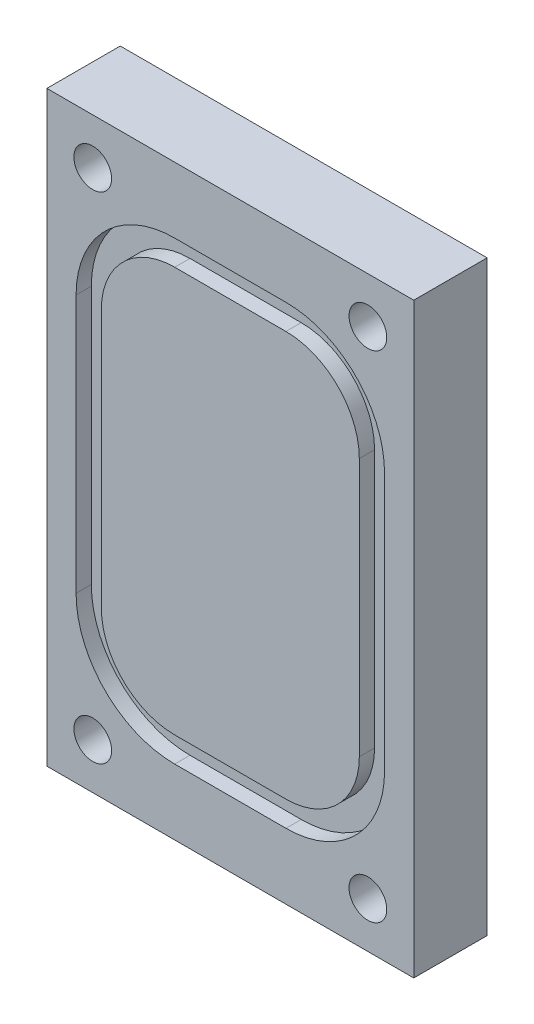
ISO-10303-21;
HEADER;
FILE_DESCRIPTION(('STEP AP214'),'2;1');
FILE_NAME('part.step','',(''),(''),'','','');
FILE_SCHEMA(('AUTOMOTIVE_DESIGN { 1 0 10303 214 1 1 1 1 }'));
ENDSEC;
DATA;
#1=APPLICATION_CONTEXT('core data for automotive mechanical design processes');
#2=APPLICATION_PROTOCOL_DEFINITION('international standard','automotive_design',2000,#1);
#3=PRODUCT_CONTEXT('',#1,'mechanical');
#4=PRODUCT('Part','Part','',(#3));
#5=PRODUCT_RELATED_PRODUCT_CATEGORY('part','',(#4));
#6=PRODUCT_DEFINITION_FORMATION('','',#4);
#7=PRODUCT_DEFINITION_CONTEXT('part definition',#1,'design');
#8=PRODUCT_DEFINITION('design','',#6,#7);
#9=PRODUCT_DEFINITION_SHAPE('','',#8);
#10=(LENGTH_UNIT() NAMED_UNIT(*) SI_UNIT(.MILLI.,.METRE.));
#11=(NAMED_UNIT(*) PLANE_ANGLE_UNIT() SI_UNIT($,.RADIAN.));
#12=(NAMED_UNIT(*) SI_UNIT($,.STERADIAN.) SOLID_ANGLE_UNIT());
#13=UNCERTAINTY_MEASURE_WITH_UNIT(LENGTH_MEASURE(1.E-05),#10,'distance_accuracy_value','');
#14=(GEOMETRIC_REPRESENTATION_CONTEXT(3) GLOBAL_UNCERTAINTY_ASSIGNED_CONTEXT((#13)) GLOBAL_UNIT_ASSIGNED_CONTEXT((#10,
#11,#12)) REPRESENTATION_CONTEXT('',''));
#15=CARTESIAN_POINT('',(0.,0.,0.));
#16=DIRECTION('',(0.,0.,1.));
#17=DIRECTION('',(1.,0.,0.));
#18=AXIS2_PLACEMENT_3D('',#15,#16,#17);
#19=CARTESIAN_POINT('',(15.875,-25.4,6.35));
#20=DIRECTION('',(-1.,0.,0.));
#21=DIRECTION('',(0.,0.,1.));
#22=AXIS2_PLACEMENT_3D('',#19,#20,#21);
#23=PLANE('',#22);
#24=DIRECTION('',(0.,1.,0.));
#25=VECTOR('',#24,1.);
#26=CARTESIAN_POINT('',(15.875,-25.4,0.));
#27=LINE('',#26,#25);
#28=CARTESIAN_POINT('',(15.875,-25.4,0.));
#29=VERTEX_POINT('',#28);
#30=CARTESIAN_POINT('',(15.875,25.4,0.));
#31=VERTEX_POINT('',#30);
#32=EDGE_CURVE('E297',#29,#31,#27,.T.);
#33=ORIENTED_EDGE('',*,*,#32,.T.);
#34=DIRECTION('',(0.,0.,-1.));
#35=VECTOR('',#34,1.);
#36=CARTESIAN_POINT('',(15.875,25.4,6.35));
#37=LINE('',#36,#35);
#38=CARTESIAN_POINT('',(15.875,25.4,6.35));
#39=VERTEX_POINT('',#38);
#40=EDGE_CURVE('E11',#39,#31,#37,.T.);
#41=ORIENTED_EDGE('',*,*,#40,.F.);
#42=DIRECTION('',(0.,1.,0.));
#43=VECTOR('',#42,1.);
#44=CARTESIAN_POINT('',(15.875,-25.4,6.35));
#45=LINE('',#44,#43);
#46=CARTESIAN_POINT('',(15.875,-25.4,6.35));
#47=VERTEX_POINT('',#46);
#48=EDGE_CURVE('E311',#47,#39,#45,.T.);
#49=ORIENTED_EDGE('',*,*,#48,.F.);
#50=DIRECTION('',(0.,0.,-1.));
#51=VECTOR('',#50,1.);
#52=CARTESIAN_POINT('',(15.875,-25.4,6.35));
#53=LINE('',#52,#51);
#54=EDGE_CURVE('E321',#47,#29,#53,.T.);
#55=ORIENTED_EDGE('',*,*,#54,.T.);
#56=EDGE_LOOP('',(#33,#41,#49,#55));
#57=FACE_BOUND('',#56,.T.);
#58=ADVANCED_FACE('F35',(#57),#23,.F.);
#59=CARTESIAN_POINT('',(-15.875,25.4,6.35));
#60=DIRECTION('',(0.,-1.,0.));
#61=DIRECTION('',(0.,0.,-1.));
#62=AXIS2_PLACEMENT_3D('',#59,#60,#61);
#63=PLANE('',#62);
#64=DIRECTION('',(-1.,0.,0.));
#65=VECTOR('',#64,1.);
#66=CARTESIAN_POINT('',(-15.875,25.4,0.));
#67=LINE('',#66,#65);
#68=CARTESIAN_POINT('',(-15.875,25.4,0.));
#69=VERTEX_POINT('',#68);
#70=EDGE_CURVE('E324',#31,#69,#67,.T.);
#71=ORIENTED_EDGE('',*,*,#70,.T.);
#72=DIRECTION('',(0.,0.,-1.));
#73=VECTOR('',#72,1.);
#74=CARTESIAN_POINT('',(-15.875,25.4,6.35));
#75=LINE('',#74,#73);
#76=CARTESIAN_POINT('',(-15.875,25.4,6.35));
#77=VERTEX_POINT('',#76);
#78=EDGE_CURVE('E42',#77,#69,#75,.T.);
#79=ORIENTED_EDGE('',*,*,#78,.F.);
#80=DIRECTION('',(-1.,0.,0.));
#81=VECTOR('',#80,1.);
#82=CARTESIAN_POINT('',(-15.875,25.4,6.35));
#83=LINE('',#82,#81);
#84=EDGE_CURVE('E314',#39,#77,#83,.T.);
#85=ORIENTED_EDGE('',*,*,#84,.F.);
#86=ORIENTED_EDGE('',*,*,#40,.T.);
#87=EDGE_LOOP('',(#71,#79,#85,#86));
#88=FACE_BOUND('',#87,.T.);
#89=ADVANCED_FACE('F354',(#88),#63,.F.);
#90=CARTESIAN_POINT('',(-15.875,-25.4,6.35));
#91=DIRECTION('',(1.,0.,0.));
#92=DIRECTION('',(0.,0.,-1.));
#93=AXIS2_PLACEMENT_3D('',#90,#91,#92);
#94=PLANE('',#93);
#95=DIRECTION('',(0.,-1.,0.));
#96=VECTOR('',#95,1.);
#97=CARTESIAN_POINT('',(-15.875,-25.4,0.));
#98=LINE('',#97,#96);
#99=CARTESIAN_POINT('',(-15.875,-25.4,0.));
#100=VERTEX_POINT('',#99);
#101=EDGE_CURVE('E326',#69,#100,#98,.T.);
#102=ORIENTED_EDGE('',*,*,#101,.T.);
#103=DIRECTION('',(0.,0.,-1.));
#104=VECTOR('',#103,1.);
#105=CARTESIAN_POINT('',(-15.875,-25.4,6.35));
#106=LINE('',#105,#104);
#107=CARTESIAN_POINT('',(-15.875,-25.4,6.35));
#108=VERTEX_POINT('',#107);
#109=EDGE_CURVE('E331',#108,#100,#106,.T.);
#110=ORIENTED_EDGE('',*,*,#109,.F.);
#111=DIRECTION('',(0.,-1.,0.));
#112=VECTOR('',#111,1.);
#113=CARTESIAN_POINT('',(-15.875,-25.4,6.35));
#114=LINE('',#113,#112);
#115=EDGE_CURVE('E317',#77,#108,#114,.T.);
#116=ORIENTED_EDGE('',*,*,#115,.F.);
#117=ORIENTED_EDGE('',*,*,#78,.T.);
#118=EDGE_LOOP('',(#102,#110,#116,#117));
#119=FACE_BOUND('',#118,.T.);
#120=ADVANCED_FACE('F338',(#119),#94,.F.);
#121=CARTESIAN_POINT('',(-15.875,-25.4,6.35));
#122=DIRECTION('',(0.,1.,0.));
#123=DIRECTION('',(0.,0.,1.));
#124=AXIS2_PLACEMENT_3D('',#121,#122,#123);
#125=PLANE('',#124);
#126=DIRECTION('',(1.,0.,0.));
#127=VECTOR('',#126,1.);
#128=CARTESIAN_POINT('',(-15.875,-25.4,0.));
#129=LINE('',#128,#127);
#130=EDGE_CURVE('E315',#100,#29,#129,.T.);
#131=ORIENTED_EDGE('',*,*,#130,.T.);
#132=ORIENTED_EDGE('',*,*,#54,.F.);
#133=DIRECTION('',(1.,0.,0.));
#134=VECTOR('',#133,1.);
#135=CARTESIAN_POINT('',(-15.875,-25.4,6.35));
#136=LINE('',#135,#134);
#137=EDGE_CURVE('E319',#108,#47,#136,.T.);
#138=ORIENTED_EDGE('',*,*,#137,.F.);
#139=ORIENTED_EDGE('',*,*,#109,.T.);
#140=EDGE_LOOP('',(#131,#132,#138,#139));
#141=FACE_BOUND('',#140,.T.);
#142=ADVANCED_FACE('F347',(#141),#125,.F.);
#143=CARTESIAN_POINT('',(15.875,25.4,6.35));
#144=DIRECTION('',(0.,0.,-1.));
#145=DIRECTION('',(-1.,0.,0.));
#146=AXIS2_PLACEMENT_3D('',#143,#144,#145);
#147=PLANE('',#146);
#148=CARTESIAN_POINT('',(11.90625,21.43125,6.35));
#149=DIRECTION('',(0.,0.,-1.));
#150=DIRECTION('',(-1.,0.,0.));
#151=AXIS2_PLACEMENT_3D('',#148,#149,#150);
#152=CIRCLE('',#151,1.63195);
#153=CARTESIAN_POINT('',(10.2743,21.43125,6.35));
#154=VERTEX_POINT('',#153);
#155=EDGE_CURVE('E472',#154,#154,#152,.T.);
#156=ORIENTED_EDGE('',*,*,#155,.T.);
#157=EDGE_LOOP('',(#156));
#158=FACE_BOUND('',#157,.T.);
#159=CARTESIAN_POINT('',(-11.90625,21.43125,6.35));
#160=DIRECTION('',(0.,0.,-1.));
#161=DIRECTION('',(-1.,0.,0.));
#162=AXIS2_PLACEMENT_3D('',#159,#160,#161);
#163=CIRCLE('',#162,1.63195);
#164=CARTESIAN_POINT('',(-13.5382,21.43125,6.35));
#165=VERTEX_POINT('',#164);
#166=EDGE_CURVE('E483',#165,#165,#163,.T.);
#167=ORIENTED_EDGE('',*,*,#166,.T.);
#168=EDGE_LOOP('',(#167));
#169=FACE_BOUND('',#168,.T.);
#170=CARTESIAN_POINT('',(11.90625,-21.43125,6.35));
#171=DIRECTION('',(0.,0.,-1.));
#172=DIRECTION('',(-1.,0.,0.));
#173=AXIS2_PLACEMENT_3D('',#170,#171,#172);
#174=CIRCLE('',#173,1.63195);
#175=CARTESIAN_POINT('',(10.2743,-21.43125,6.35));
#176=VERTEX_POINT('',#175);
#177=EDGE_CURVE('E492',#176,#176,#174,.T.);
#178=ORIENTED_EDGE('',*,*,#177,.T.);
#179=EDGE_LOOP('',(#178));
#180=FACE_BOUND('',#179,.T.);
#181=CARTESIAN_POINT('',(-11.90625,-21.43125,6.35));
#182=DIRECTION('',(0.,0.,-1.));
#183=DIRECTION('',(-1.,0.,0.));
#184=AXIS2_PLACEMENT_3D('',#181,#182,#183);
#185=CIRCLE('',#184,1.63195);
#186=CARTESIAN_POINT('',(-13.5382,-21.43125,6.35));
#187=VERTEX_POINT('',#186);
#188=EDGE_CURVE('E204',#187,#187,#185,.T.);
#189=ORIENTED_EDGE('',*,*,#188,.T.);
#190=EDGE_LOOP('',(#189));
#191=FACE_BOUND('',#190,.T.);
#192=DIRECTION('',(-1.,0.,0.));
#193=VECTOR('',#192,1.);
#194=CARTESIAN_POINT('',(-4.8133,19.7104,6.35));
#195=LINE('',#194,#193);
#196=CARTESIAN_POINT('',(4.8133,19.7104,6.35));
#197=VERTEX_POINT('',#196);
#198=CARTESIAN_POINT('',(-4.8133,19.7104,6.35));
#199=VERTEX_POINT('',#198);
#200=EDGE_CURVE('E275',#197,#199,#195,.T.);
#201=ORIENTED_EDGE('',*,*,#200,.F.);
#202=CARTESIAN_POINT('',(4.8133,11.176,6.35));
#203=DIRECTION('',(0.,0.,1.));
#204=DIRECTION('',(-1.,0.,0.));
#205=AXIS2_PLACEMENT_3D('',#202,#203,#204);
#206=CIRCLE('',#205,8.5344);
#207=CARTESIAN_POINT('',(13.3477,11.176,6.35));
#208=VERTEX_POINT('',#207);
#209=EDGE_CURVE('E49',#208,#197,#206,.T.);
#210=ORIENTED_EDGE('',*,*,#209,.F.);
#211=DIRECTION('',(0.,1.,0.));
#212=VECTOR('',#211,1.);
#213=CARTESIAN_POINT('',(13.3477,-11.176,6.35));
#214=LINE('',#213,#212);
#215=CARTESIAN_POINT('',(13.3477,-11.176,6.35));
#216=VERTEX_POINT('',#215);
#217=EDGE_CURVE('E252',#216,#208,#214,.T.);
#218=ORIENTED_EDGE('',*,*,#217,.F.);
#219=CARTESIAN_POINT('',(4.8133,-11.176,6.35));
#220=DIRECTION('',(0.,0.,1.));
#221=DIRECTION('',(1.,0.,0.));
#222=AXIS2_PLACEMENT_3D('',#219,#220,#221);
#223=CIRCLE('',#222,8.5344);
#224=CARTESIAN_POINT('',(4.8133,-19.7104,6.35));
#225=VERTEX_POINT('',#224);
#226=EDGE_CURVE('E290',#225,#216,#223,.T.);
#227=ORIENTED_EDGE('',*,*,#226,.F.);
#228=DIRECTION('',(1.,0.,0.));
#229=VECTOR('',#228,1.);
#230=CARTESIAN_POINT('',(-4.8133,-19.7104,6.35));
#231=LINE('',#230,#229);
#232=CARTESIAN_POINT('',(-4.8133,-19.7104,6.35));
#233=VERTEX_POINT('',#232);
#234=EDGE_CURVE('E287',#233,#225,#231,.T.);
#235=ORIENTED_EDGE('',*,*,#234,.F.);
#236=CARTESIAN_POINT('',(-4.8133,-11.176,6.35));
#237=DIRECTION('',(0.,0.,1.));
#238=DIRECTION('',(-1.,0.,0.));
#239=AXIS2_PLACEMENT_3D('',#236,#237,#238);
#240=CIRCLE('',#239,8.5344);
#241=CARTESIAN_POINT('',(-13.3477,-11.176,6.35));
#242=VERTEX_POINT('',#241);
#243=EDGE_CURVE('E284',#242,#233,#240,.T.);
#244=ORIENTED_EDGE('',*,*,#243,.F.);
#245=DIRECTION('',(0.,-1.,0.));
#246=VECTOR('',#245,1.);
#247=CARTESIAN_POINT('',(-13.3477,-11.176,6.35));
#248=LINE('',#247,#246);
#249=CARTESIAN_POINT('',(-13.3477,11.176,6.35));
#250=VERTEX_POINT('',#249);
#251=EDGE_CURVE('E281',#250,#242,#248,.T.);
#252=ORIENTED_EDGE('',*,*,#251,.F.);
#253=CARTESIAN_POINT('',(-4.8133,11.176,6.35));
#254=DIRECTION('',(0.,0.,1.));
#255=DIRECTION('',(-1.,0.,0.));
#256=AXIS2_PLACEMENT_3D('',#253,#254,#255);
#257=CIRCLE('',#256,8.5344);
#258=EDGE_CURVE('E278',#199,#250,#257,.T.);
#259=ORIENTED_EDGE('',*,*,#258,.F.);
#260=EDGE_LOOP('',(#201,#210,#218,#227,#235,#244,#252,#259));
#261=FACE_BOUND('',#260,.T.);
#262=ORIENTED_EDGE('',*,*,#48,.T.);
#263=ORIENTED_EDGE('',*,*,#84,.T.);
#264=ORIENTED_EDGE('',*,*,#115,.T.);
#265=ORIENTED_EDGE('',*,*,#137,.T.);
#266=EDGE_LOOP('',(#262,#263,#264,#265));
#267=FACE_BOUND('',#266,.T.);
#268=ADVANCED_FACE('F353',(#158,#169,#180,#191,#261,#267),#147,.F.);
#269=CARTESIAN_POINT('',(15.875,25.4,0.));
#270=DIRECTION('',(0.,0.,-1.));
#271=DIRECTION('',(-1.,0.,0.));
#272=AXIS2_PLACEMENT_3D('',#269,#270,#271);
#273=PLANE('',#272);
#274=CARTESIAN_POINT('',(11.90625,21.43125,0.));
#275=DIRECTION('',(0.,0.,-1.));
#276=DIRECTION('',(-1.,0.,0.));
#277=AXIS2_PLACEMENT_3D('',#274,#275,#276);
#278=CIRCLE('',#277,2.8575);
#279=CARTESIAN_POINT('',(9.04875,21.43125,0.));
#280=VERTEX_POINT('',#279);
#281=EDGE_CURVE('E470',#280,#280,#278,.T.);
#282=ORIENTED_EDGE('',*,*,#281,.F.);
#283=EDGE_LOOP('',(#282));
#284=FACE_BOUND('',#283,.T.);
#285=CARTESIAN_POINT('',(-11.90625,21.43125,0.));
#286=DIRECTION('',(0.,0.,-1.));
#287=DIRECTION('',(-1.,0.,0.));
#288=AXIS2_PLACEMENT_3D('',#285,#286,#287);
#289=CIRCLE('',#288,2.8575);
#290=CARTESIAN_POINT('',(-14.76375,21.43125,0.));
#291=VERTEX_POINT('',#290);
#292=EDGE_CURVE('E477',#291,#291,#289,.T.);
#293=ORIENTED_EDGE('',*,*,#292,.F.);
#294=EDGE_LOOP('',(#293));
#295=FACE_BOUND('',#294,.T.);
#296=CARTESIAN_POINT('',(11.90625,-21.43125,0.));
#297=DIRECTION('',(0.,0.,-1.));
#298=DIRECTION('',(-1.,0.,0.));
#299=AXIS2_PLACEMENT_3D('',#296,#297,#298);
#300=CIRCLE('',#299,2.8575);
#301=CARTESIAN_POINT('',(9.04875,-21.43125,0.));
#302=VERTEX_POINT('',#301);
#303=EDGE_CURVE('E486',#302,#302,#300,.T.);
#304=ORIENTED_EDGE('',*,*,#303,.F.);
#305=EDGE_LOOP('',(#304));
#306=FACE_BOUND('',#305,.T.);
#307=CARTESIAN_POINT('',(-11.90625,-21.43125,0.));
#308=DIRECTION('',(0.,0.,-1.));
#309=DIRECTION('',(-1.,0.,0.));
#310=AXIS2_PLACEMENT_3D('',#307,#308,#309);
#311=CIRCLE('',#310,2.8575);
#312=CARTESIAN_POINT('',(-14.76375,-21.43125,0.));
#313=VERTEX_POINT('',#312);
#314=EDGE_CURVE('E495',#313,#313,#311,.T.);
#315=ORIENTED_EDGE('',*,*,#314,.F.);
#316=EDGE_LOOP('',(#315));
#317=FACE_BOUND('',#316,.T.);
#318=ORIENTED_EDGE('',*,*,#32,.F.);
#319=ORIENTED_EDGE('',*,*,#130,.F.);
#320=ORIENTED_EDGE('',*,*,#101,.F.);
#321=ORIENTED_EDGE('',*,*,#70,.F.);
#322=EDGE_LOOP('',(#318,#319,#320,#321));
#323=FACE_BOUND('',#322,.T.);
#324=ADVANCED_FACE('F344',(#284,#295,#306,#317,#323),#273,.T.);
#325=CARTESIAN_POINT('',(4.8133,11.176,5.0292));
#326=DIRECTION('',(0.,0.,1.));
#327=DIRECTION('',(1.,0.,0.));
#328=AXIS2_PLACEMENT_3D('',#325,#326,#327);
#329=CYLINDRICAL_SURFACE('',#328,8.5344);
#330=ORIENTED_EDGE('',*,*,#209,.T.);
#331=DIRECTION('',(0.,0.,1.));
#332=VECTOR('',#331,1.);
#333=CARTESIAN_POINT('',(4.8133,19.7104,5.0292));
#334=LINE('',#333,#332);
#335=CARTESIAN_POINT('',(4.8133,19.7104,5.0292));
#336=VERTEX_POINT('',#335);
#337=EDGE_CURVE('E273',#336,#197,#334,.T.);
#338=ORIENTED_EDGE('',*,*,#337,.F.);
#339=CARTESIAN_POINT('',(4.8133,11.176,5.0292));
#340=DIRECTION('',(0.,0.,1.));
#341=DIRECTION('',(-1.,0.,0.));
#342=AXIS2_PLACEMENT_3D('',#339,#340,#341);
#343=CIRCLE('',#342,8.5344);
#344=CARTESIAN_POINT('',(13.3477,11.176,5.0292));
#345=VERTEX_POINT('',#344);
#346=EDGE_CURVE('E248',#345,#336,#343,.T.);
#347=ORIENTED_EDGE('',*,*,#346,.F.);
#348=DIRECTION('',(0.,0.,1.));
#349=VECTOR('',#348,1.);
#350=CARTESIAN_POINT('',(13.3477,11.176,5.0292));
#351=LINE('',#350,#349);
#352=EDGE_CURVE('E295',#345,#208,#351,.T.);
#353=ORIENTED_EDGE('',*,*,#352,.T.);
#354=EDGE_LOOP('',(#330,#338,#347,#353));
#355=FACE_BOUND('',#354,.T.);
#356=ADVANCED_FACE('F366',(#355),#329,.F.);
#357=CARTESIAN_POINT('',(13.3477,-11.176,5.0292));
#358=DIRECTION('',(1.,0.,0.));
#359=DIRECTION('',(0.,0.,-1.));
#360=AXIS2_PLACEMENT_3D('',#357,#358,#359);
#361=PLANE('',#360);
#362=ORIENTED_EDGE('',*,*,#217,.T.);
#363=ORIENTED_EDGE('',*,*,#352,.F.);
#364=DIRECTION('',(0.,1.,0.));
#365=VECTOR('',#364,1.);
#366=CARTESIAN_POINT('',(13.3477,-11.176,5.0292));
#367=LINE('',#366,#365);
#368=CARTESIAN_POINT('',(13.3477,-11.176,5.0292));
#369=VERTEX_POINT('',#368);
#370=EDGE_CURVE('E270',#369,#345,#367,.T.);
#371=ORIENTED_EDGE('',*,*,#370,.F.);
#372=DIRECTION('',(0.,0.,1.));
#373=VECTOR('',#372,1.);
#374=CARTESIAN_POINT('',(13.3477,-11.176,5.0292));
#375=LINE('',#374,#373);
#376=EDGE_CURVE('E298',#369,#216,#375,.T.);
#377=ORIENTED_EDGE('',*,*,#376,.T.);
#378=EDGE_LOOP('',(#362,#363,#371,#377));
#379=FACE_BOUND('',#378,.T.);
#380=ADVANCED_FACE('F374',(#379),#361,.F.);
#381=CARTESIAN_POINT('',(4.8133,-11.176,5.0292));
#382=DIRECTION('',(0.,0.,1.));
#383=DIRECTION('',(1.,0.,0.));
#384=AXIS2_PLACEMENT_3D('',#381,#382,#383);
#385=CYLINDRICAL_SURFACE('',#384,8.5344);
#386=ORIENTED_EDGE('',*,*,#226,.T.);
#387=ORIENTED_EDGE('',*,*,#376,.F.);
#388=CARTESIAN_POINT('',(4.8133,-11.176,5.0292));
#389=DIRECTION('',(0.,0.,1.));
#390=DIRECTION('',(1.,0.,0.));
#391=AXIS2_PLACEMENT_3D('',#388,#389,#390);
#392=CIRCLE('',#391,8.5344);
#393=CARTESIAN_POINT('',(4.8133,-19.7104,5.0292));
#394=VERTEX_POINT('',#393);
#395=EDGE_CURVE('E267',#394,#369,#392,.T.);
#396=ORIENTED_EDGE('',*,*,#395,.F.);
#397=DIRECTION('',(0.,0.,1.));
#398=VECTOR('',#397,1.);
#399=CARTESIAN_POINT('',(4.8133,-19.7104,5.0292));
#400=LINE('',#399,#398);
#401=EDGE_CURVE('E300',#394,#225,#400,.T.);
#402=ORIENTED_EDGE('',*,*,#401,.T.);
#403=EDGE_LOOP('',(#386,#387,#396,#402));
#404=FACE_BOUND('',#403,.T.);
#405=ADVANCED_FACE('F394',(#404),#385,.F.);
#406=CARTESIAN_POINT('',(-4.8133,-19.7104,5.0292));
#407=DIRECTION('',(0.,-1.,0.));
#408=DIRECTION('',(0.,0.,-1.));
#409=AXIS2_PLACEMENT_3D('',#406,#407,#408);
#410=PLANE('',#409);
#411=ORIENTED_EDGE('',*,*,#234,.T.);
#412=ORIENTED_EDGE('',*,*,#401,.F.);
#413=DIRECTION('',(1.,0.,0.));
#414=VECTOR('',#413,1.);
#415=CARTESIAN_POINT('',(-4.8133,-19.7104,5.0292));
#416=LINE('',#415,#414);
#417=CARTESIAN_POINT('',(-4.8133,-19.7104,5.0292));
#418=VERTEX_POINT('',#417);
#419=EDGE_CURVE('E264',#418,#394,#416,.T.);
#420=ORIENTED_EDGE('',*,*,#419,.F.);
#421=DIRECTION('',(0.,0.,1.));
#422=VECTOR('',#421,1.);
#423=CARTESIAN_POINT('',(-4.8133,-19.7104,5.0292));
#424=LINE('',#423,#422);
#425=EDGE_CURVE('E302',#418,#233,#424,.T.);
#426=ORIENTED_EDGE('',*,*,#425,.T.);
#427=EDGE_LOOP('',(#411,#412,#420,#426));
#428=FACE_BOUND('',#427,.T.);
#429=ADVANCED_FACE('F390',(#428),#410,.F.);
#430=CARTESIAN_POINT('',(-4.8133,-11.176,5.0292));
#431=DIRECTION('',(0.,0.,1.));
#432=DIRECTION('',(1.,0.,0.));
#433=AXIS2_PLACEMENT_3D('',#430,#431,#432);
#434=CYLINDRICAL_SURFACE('',#433,8.5344);
#435=ORIENTED_EDGE('',*,*,#243,.T.);
#436=ORIENTED_EDGE('',*,*,#425,.F.);
#437=CARTESIAN_POINT('',(-4.8133,-11.176,5.0292));
#438=DIRECTION('',(0.,0.,1.));
#439=DIRECTION('',(-1.,0.,0.));
#440=AXIS2_PLACEMENT_3D('',#437,#438,#439);
#441=CIRCLE('',#440,8.5344);
#442=CARTESIAN_POINT('',(-13.3477,-11.176,5.0292));
#443=VERTEX_POINT('',#442);
#444=EDGE_CURVE('E261',#443,#418,#441,.T.);
#445=ORIENTED_EDGE('',*,*,#444,.F.);
#446=DIRECTION('',(0.,0.,1.));
#447=VECTOR('',#446,1.);
#448=CARTESIAN_POINT('',(-13.3477,-11.176,5.0292));
#449=LINE('',#448,#447);
#450=EDGE_CURVE('E304',#443,#242,#449,.T.);
#451=ORIENTED_EDGE('',*,*,#450,.T.);
#452=EDGE_LOOP('',(#435,#436,#445,#451));
#453=FACE_BOUND('',#452,.T.);
#454=ADVANCED_FACE('F386',(#453),#434,.F.);
#455=CARTESIAN_POINT('',(-13.3477,-11.176,5.0292));
#456=DIRECTION('',(-1.,0.,0.));
#457=DIRECTION('',(0.,0.,1.));
#458=AXIS2_PLACEMENT_3D('',#455,#456,#457);
#459=PLANE('',#458);
#460=ORIENTED_EDGE('',*,*,#251,.T.);
#461=ORIENTED_EDGE('',*,*,#450,.F.);
#462=DIRECTION('',(0.,-1.,0.));
#463=VECTOR('',#462,1.);
#464=CARTESIAN_POINT('',(-13.3477,-11.176,5.0292));
#465=LINE('',#464,#463);
#466=CARTESIAN_POINT('',(-13.3477,11.176,5.0292));
#467=VERTEX_POINT('',#466);
#468=EDGE_CURVE('E258',#467,#443,#465,.T.);
#469=ORIENTED_EDGE('',*,*,#468,.F.);
#470=DIRECTION('',(0.,0.,1.));
#471=VECTOR('',#470,1.);
#472=CARTESIAN_POINT('',(-13.3477,11.176,5.0292));
#473=LINE('',#472,#471);
#474=EDGE_CURVE('E306',#467,#250,#473,.T.);
#475=ORIENTED_EDGE('',*,*,#474,.T.);
#476=EDGE_LOOP('',(#460,#461,#469,#475));
#477=FACE_BOUND('',#476,.T.);
#478=ADVANCED_FACE('F382',(#477),#459,.F.);
#479=CARTESIAN_POINT('',(-4.8133,11.176,5.0292));
#480=DIRECTION('',(0.,0.,1.));
#481=DIRECTION('',(1.,0.,0.));
#482=AXIS2_PLACEMENT_3D('',#479,#480,#481);
#483=CYLINDRICAL_SURFACE('',#482,8.5344);
#484=ORIENTED_EDGE('',*,*,#258,.T.);
#485=ORIENTED_EDGE('',*,*,#474,.F.);
#486=CARTESIAN_POINT('',(-4.8133,11.176,5.0292));
#487=DIRECTION('',(0.,0.,1.));
#488=DIRECTION('',(-1.,0.,0.));
#489=AXIS2_PLACEMENT_3D('',#486,#487,#488);
#490=CIRCLE('',#489,8.5344);
#491=CARTESIAN_POINT('',(-4.8133,19.7104,5.0292));
#492=VERTEX_POINT('',#491);
#493=EDGE_CURVE('E255',#492,#467,#490,.T.);
#494=ORIENTED_EDGE('',*,*,#493,.F.);
#495=DIRECTION('',(0.,0.,1.));
#496=VECTOR('',#495,1.);
#497=CARTESIAN_POINT('',(-4.8133,19.7104,5.0292));
#498=LINE('',#497,#496);
#499=EDGE_CURVE('E308',#492,#199,#498,.T.);
#500=ORIENTED_EDGE('',*,*,#499,.T.);
#501=EDGE_LOOP('',(#484,#485,#494,#500));
#502=FACE_BOUND('',#501,.T.);
#503=ADVANCED_FACE('F378',(#502),#483,.F.);
#504=CARTESIAN_POINT('',(-4.8133,19.7104,5.0292));
#505=DIRECTION('',(0.,1.,0.));
#506=DIRECTION('',(0.,0.,1.));
#507=AXIS2_PLACEMENT_3D('',#504,#505,#506);
#508=PLANE('',#507);
#509=ORIENTED_EDGE('',*,*,#200,.T.);
#510=ORIENTED_EDGE('',*,*,#499,.F.);
#511=DIRECTION('',(-1.,0.,0.));
#512=VECTOR('',#511,1.);
#513=CARTESIAN_POINT('',(-4.8133,19.7104,5.0292));
#514=LINE('',#513,#512);
#515=EDGE_CURVE('E251',#336,#492,#514,.T.);
#516=ORIENTED_EDGE('',*,*,#515,.F.);
#517=ORIENTED_EDGE('',*,*,#337,.T.);
#518=EDGE_LOOP('',(#509,#510,#516,#517));
#519=FACE_BOUND('',#518,.T.);
#520=ADVANCED_FACE('F375',(#519),#508,.F.);
#521=CARTESIAN_POINT('',(4.8133,11.176,5.0292));
#522=DIRECTION('',(0.,0.,-1.));
#523=DIRECTION('',(-1.,0.,0.));
#524=AXIS2_PLACEMENT_3D('',#521,#522,#523);
#525=PLANE('',#524);
#526=CARTESIAN_POINT('',(-4.8133,-11.176,5.0292));
#527=DIRECTION('',(0.,0.,1.));
#528=DIRECTION('',(-1.,0.,0.));
#529=AXIS2_PLACEMENT_3D('',#526,#527,#528);
#530=CIRCLE('',#529,6.35);
#531=CARTESIAN_POINT('',(-11.1633,-11.176,5.0292));
#532=VERTEX_POINT('',#531);
#533=CARTESIAN_POINT('',(-4.8133,-17.526,5.0292));
#534=VERTEX_POINT('',#533);
#535=EDGE_CURVE('E190',#532,#534,#530,.T.);
#536=ORIENTED_EDGE('',*,*,#535,.F.);
#537=DIRECTION('',(0.,-1.,0.));
#538=VECTOR('',#537,1.);
#539=CARTESIAN_POINT('',(-11.1633,-11.176,5.0292));
#540=LINE('',#539,#538);
#541=CARTESIAN_POINT('',(-11.1633,11.176,5.0292));
#542=VERTEX_POINT('',#541);
#543=EDGE_CURVE('E183',#542,#532,#540,.T.);
#544=ORIENTED_EDGE('',*,*,#543,.F.);
#545=CARTESIAN_POINT('',(-4.8133,11.176,5.0292));
#546=DIRECTION('',(0.,0.,1.));
#547=DIRECTION('',(-1.,0.,0.));
#548=AXIS2_PLACEMENT_3D('',#545,#546,#547);
#549=CIRCLE('',#548,6.35);
#550=CARTESIAN_POINT('',(-4.8133,17.526,5.0292));
#551=VERTEX_POINT('',#550);
#552=EDGE_CURVE('E217',#551,#542,#549,.T.);
#553=ORIENTED_EDGE('',*,*,#552,.F.);
#554=DIRECTION('',(-1.,0.,0.));
#555=VECTOR('',#554,1.);
#556=CARTESIAN_POINT('',(-4.8133,17.526,5.0292));
#557=LINE('',#556,#555);
#558=CARTESIAN_POINT('',(4.8133,17.526,5.0292));
#559=VERTEX_POINT('',#558);
#560=EDGE_CURVE('E214',#559,#551,#557,.T.);
#561=ORIENTED_EDGE('',*,*,#560,.F.);
#562=CARTESIAN_POINT('',(4.8133,11.176,5.0292));
#563=DIRECTION('',(0.,0.,1.));
#564=DIRECTION('',(-1.,0.,0.));
#565=AXIS2_PLACEMENT_3D('',#562,#563,#564);
#566=CIRCLE('',#565,6.35);
#567=CARTESIAN_POINT('',(11.1633,11.176,5.0292));
#568=VERTEX_POINT('',#567);
#569=EDGE_CURVE('E211',#568,#559,#566,.T.);
#570=ORIENTED_EDGE('',*,*,#569,.F.);
#571=DIRECTION('',(0.,1.,0.));
#572=VECTOR('',#571,1.);
#573=CARTESIAN_POINT('',(11.1633,-11.176,5.0292));
#574=LINE('',#573,#572);
#575=CARTESIAN_POINT('',(11.1633,-11.176,5.0292));
#576=VERTEX_POINT('',#575);
#577=EDGE_CURVE('E208',#576,#568,#574,.T.);
#578=ORIENTED_EDGE('',*,*,#577,.F.);
#579=CARTESIAN_POINT('',(4.8133,-11.176,5.0292));
#580=DIRECTION('',(0.,0.,1.));
#581=DIRECTION('',(1.,0.,0.));
#582=AXIS2_PLACEMENT_3D('',#579,#580,#581);
#583=CIRCLE('',#582,6.35);
#584=CARTESIAN_POINT('',(4.8133,-17.526,5.0292));
#585=VERTEX_POINT('',#584);
#586=EDGE_CURVE('E194',#585,#576,#583,.T.);
#587=ORIENTED_EDGE('',*,*,#586,.F.);
#588=DIRECTION('',(1.,0.,0.));
#589=VECTOR('',#588,1.);
#590=CARTESIAN_POINT('',(-4.8133,-17.526,5.0292));
#591=LINE('',#590,#589);
#592=EDGE_CURVE('E175',#534,#585,#591,.T.);
#593=ORIENTED_EDGE('',*,*,#592,.F.);
#594=EDGE_LOOP('',(#536,#544,#553,#561,#570,#578,#587,#593));
#595=FACE_BOUND('',#594,.T.);
#596=ORIENTED_EDGE('',*,*,#346,.T.);
#597=ORIENTED_EDGE('',*,*,#515,.T.);
#598=ORIENTED_EDGE('',*,*,#493,.T.);
#599=ORIENTED_EDGE('',*,*,#468,.T.);
#600=ORIENTED_EDGE('',*,*,#444,.T.);
#601=ORIENTED_EDGE('',*,*,#419,.T.);
#602=ORIENTED_EDGE('',*,*,#395,.T.);
#603=ORIENTED_EDGE('',*,*,#370,.T.);
#604=EDGE_LOOP('',(#596,#597,#598,#599,#600,#601,#602,#603));
#605=FACE_BOUND('',#604,.T.);
#606=ADVANCED_FACE('F187',(#595,#605),#525,.F.);
#607=CARTESIAN_POINT('',(-4.8133,-11.176,5.0292));
#608=DIRECTION('',(0.,0.,1.));
#609=DIRECTION('',(1.,0.,0.));
#610=AXIS2_PLACEMENT_3D('',#607,#608,#609);
#611=CYLINDRICAL_SURFACE('',#610,6.35);
#612=CARTESIAN_POINT('',(-4.8133,-11.176,6.35));
#613=DIRECTION('',(0.,0.,1.));
#614=DIRECTION('',(-1.,0.,0.));
#615=AXIS2_PLACEMENT_3D('',#612,#613,#614);
#616=CIRCLE('',#615,6.35);
#617=CARTESIAN_POINT('',(-11.1633,-11.176,6.35));
#618=VERTEX_POINT('',#617);
#619=CARTESIAN_POINT('',(-4.8133,-17.526,6.35));
#620=VERTEX_POINT('',#619);
#621=EDGE_CURVE('E221',#618,#620,#616,.T.);
#622=ORIENTED_EDGE('',*,*,#621,.F.);
#623=DIRECTION('',(0.,0.,1.));
#624=VECTOR('',#623,1.);
#625=CARTESIAN_POINT('',(-11.1633,-11.176,5.0292));
#626=LINE('',#625,#624);
#627=EDGE_CURVE('E197',#532,#618,#626,.T.);
#628=ORIENTED_EDGE('',*,*,#627,.F.);
#629=ORIENTED_EDGE('',*,*,#535,.T.);
#630=DIRECTION('',(0.,0.,1.));
#631=VECTOR('',#630,1.);
#632=CARTESIAN_POINT('',(-4.8133,-17.526,5.0292));
#633=LINE('',#632,#631);
#634=EDGE_CURVE('E172',#534,#620,#633,.T.);
#635=ORIENTED_EDGE('',*,*,#634,.T.);
#636=EDGE_LOOP('',(#622,#628,#629,#635));
#637=FACE_BOUND('',#636,.T.);
#638=ADVANCED_FACE('F196',(#637),#611,.T.);
#639=CARTESIAN_POINT('',(-11.1633,-11.176,5.0292));
#640=DIRECTION('',(-1.,0.,0.));
#641=DIRECTION('',(0.,0.,1.));
#642=AXIS2_PLACEMENT_3D('',#639,#640,#641);
#643=PLANE('',#642);
#644=DIRECTION('',(0.,-1.,0.));
#645=VECTOR('',#644,1.);
#646=CARTESIAN_POINT('',(-11.1633,-11.176,6.35));
#647=LINE('',#646,#645);
#648=CARTESIAN_POINT('',(-11.1633,11.176,6.35));
#649=VERTEX_POINT('',#648);
#650=EDGE_CURVE('E198',#649,#618,#647,.T.);
#651=ORIENTED_EDGE('',*,*,#650,.F.);
#652=DIRECTION('',(0.,0.,1.));
#653=VECTOR('',#652,1.);
#654=CARTESIAN_POINT('',(-11.1633,11.176,5.0292));
#655=LINE('',#654,#653);
#656=EDGE_CURVE('E237',#542,#649,#655,.T.);
#657=ORIENTED_EDGE('',*,*,#656,.F.);
#658=ORIENTED_EDGE('',*,*,#543,.T.);
#659=ORIENTED_EDGE('',*,*,#627,.T.);
#660=EDGE_LOOP('',(#651,#657,#658,#659));
#661=FACE_BOUND('',#660,.T.);
#662=ADVANCED_FACE('F406',(#661),#643,.T.);
#663=CARTESIAN_POINT('',(-4.8133,11.176,5.0292));
#664=DIRECTION('',(0.,0.,1.));
#665=DIRECTION('',(1.,0.,0.));
#666=AXIS2_PLACEMENT_3D('',#663,#664,#665);
#667=CYLINDRICAL_SURFACE('',#666,6.35);
#668=CARTESIAN_POINT('',(-4.8133,11.176,6.35));
#669=DIRECTION('',(0.,0.,1.));
#670=DIRECTION('',(-1.,0.,0.));
#671=AXIS2_PLACEMENT_3D('',#668,#669,#670);
#672=CIRCLE('',#671,6.35);
#673=CARTESIAN_POINT('',(-4.8133,17.526,6.35));
#674=VERTEX_POINT('',#673);
#675=EDGE_CURVE('E201',#674,#649,#672,.T.);
#676=ORIENTED_EDGE('',*,*,#675,.F.);
#677=DIRECTION('',(0.,0.,1.));
#678=VECTOR('',#677,1.);
#679=CARTESIAN_POINT('',(-4.8133,17.526,5.0292));
#680=LINE('',#679,#678);
#681=EDGE_CURVE('E239',#551,#674,#680,.T.);
#682=ORIENTED_EDGE('',*,*,#681,.F.);
#683=ORIENTED_EDGE('',*,*,#552,.T.);
#684=ORIENTED_EDGE('',*,*,#656,.T.);
#685=EDGE_LOOP('',(#676,#682,#683,#684));
#686=FACE_BOUND('',#685,.T.);
#687=ADVANCED_FACE('F423',(#686),#667,.T.);
#688=CARTESIAN_POINT('',(-4.8133,17.526,5.0292));
#689=DIRECTION('',(0.,1.,0.));
#690=DIRECTION('',(0.,0.,1.));
#691=AXIS2_PLACEMENT_3D('',#688,#689,#690);
#692=PLANE('',#691);
#693=DIRECTION('',(-1.,0.,0.));
#694=VECTOR('',#693,1.);
#695=CARTESIAN_POINT('',(-4.8133,17.526,6.35));
#696=LINE('',#695,#694);
#697=CARTESIAN_POINT('',(4.8133,17.526,6.35));
#698=VERTEX_POINT('',#697);
#699=EDGE_CURVE('E231',#698,#674,#696,.T.);
#700=ORIENTED_EDGE('',*,*,#699,.F.);
#701=DIRECTION('',(0.,0.,1.));
#702=VECTOR('',#701,1.);
#703=CARTESIAN_POINT('',(4.8133,17.526,5.0292));
#704=LINE('',#703,#702);
#705=EDGE_CURVE('E241',#559,#698,#704,.T.);
#706=ORIENTED_EDGE('',*,*,#705,.F.);
#707=ORIENTED_EDGE('',*,*,#560,.T.);
#708=ORIENTED_EDGE('',*,*,#681,.T.);
#709=EDGE_LOOP('',(#700,#706,#707,#708));
#710=FACE_BOUND('',#709,.T.);
#711=ADVANCED_FACE('F419',(#710),#692,.T.);
#712=CARTESIAN_POINT('',(4.8133,11.176,5.0292));
#713=DIRECTION('',(0.,0.,1.));
#714=DIRECTION('',(1.,0.,0.));
#715=AXIS2_PLACEMENT_3D('',#712,#713,#714);
#716=CYLINDRICAL_SURFACE('',#715,6.35);
#717=CARTESIAN_POINT('',(4.8133,11.176,6.35));
#718=DIRECTION('',(0.,0.,1.));
#719=DIRECTION('',(-1.,0.,0.));
#720=AXIS2_PLACEMENT_3D('',#717,#718,#719);
#721=CIRCLE('',#720,6.35);
#722=CARTESIAN_POINT('',(11.1633,11.176,6.35));
#723=VERTEX_POINT('',#722);
#724=EDGE_CURVE('E228',#723,#698,#721,.T.);
#725=ORIENTED_EDGE('',*,*,#724,.F.);
#726=DIRECTION('',(0.,0.,1.));
#727=VECTOR('',#726,1.);
#728=CARTESIAN_POINT('',(11.1633,11.176,5.0292));
#729=LINE('',#728,#727);
#730=EDGE_CURVE('E243',#568,#723,#729,.T.);
#731=ORIENTED_EDGE('',*,*,#730,.F.);
#732=ORIENTED_EDGE('',*,*,#569,.T.);
#733=ORIENTED_EDGE('',*,*,#705,.T.);
#734=EDGE_LOOP('',(#725,#731,#732,#733));
#735=FACE_BOUND('',#734,.T.);
#736=ADVANCED_FACE('F415',(#735),#716,.T.);
#737=CARTESIAN_POINT('',(11.1633,-11.176,5.0292));
#738=DIRECTION('',(1.,0.,0.));
#739=DIRECTION('',(0.,0.,-1.));
#740=AXIS2_PLACEMENT_3D('',#737,#738,#739);
#741=PLANE('',#740);
#742=DIRECTION('',(0.,1.,0.));
#743=VECTOR('',#742,1.);
#744=CARTESIAN_POINT('',(11.1633,-11.176,6.35));
#745=LINE('',#744,#743);
#746=CARTESIAN_POINT('',(11.1633,-11.176,6.35));
#747=VERTEX_POINT('',#746);
#748=EDGE_CURVE('E225',#747,#723,#745,.T.);
#749=ORIENTED_EDGE('',*,*,#748,.F.);
#750=DIRECTION('',(0.,0.,1.));
#751=VECTOR('',#750,1.);
#752=CARTESIAN_POINT('',(11.1633,-11.176,5.0292));
#753=LINE('',#752,#751);
#754=EDGE_CURVE('E245',#576,#747,#753,.T.);
#755=ORIENTED_EDGE('',*,*,#754,.F.);
#756=ORIENTED_EDGE('',*,*,#577,.T.);
#757=ORIENTED_EDGE('',*,*,#730,.T.);
#758=EDGE_LOOP('',(#749,#755,#756,#757));
#759=FACE_BOUND('',#758,.T.);
#760=ADVANCED_FACE('F412',(#759),#741,.T.);
#761=CARTESIAN_POINT('',(4.8133,-11.176,5.0292));
#762=DIRECTION('',(0.,0.,1.));
#763=DIRECTION('',(1.,0.,0.));
#764=AXIS2_PLACEMENT_3D('',#761,#762,#763);
#765=CYLINDRICAL_SURFACE('',#764,6.35);
#766=CARTESIAN_POINT('',(4.8133,-11.176,6.35));
#767=DIRECTION('',(0.,0.,1.));
#768=DIRECTION('',(1.,0.,0.));
#769=AXIS2_PLACEMENT_3D('',#766,#767,#768);
#770=CIRCLE('',#769,6.35);
#771=CARTESIAN_POINT('',(4.8133,-17.526,6.35));
#772=VERTEX_POINT('',#771);
#773=EDGE_CURVE('E57',#772,#747,#770,.T.);
#774=ORIENTED_EDGE('',*,*,#773,.F.);
#775=DIRECTION('',(0.,0.,1.));
#776=VECTOR('',#775,1.);
#777=CARTESIAN_POINT('',(4.8133,-17.526,5.0292));
#778=LINE('',#777,#776);
#779=EDGE_CURVE('E182',#585,#772,#778,.T.);
#780=ORIENTED_EDGE('',*,*,#779,.F.);
#781=ORIENTED_EDGE('',*,*,#586,.T.);
#782=ORIENTED_EDGE('',*,*,#754,.T.);
#783=EDGE_LOOP('',(#774,#780,#781,#782));
#784=FACE_BOUND('',#783,.T.);
#785=ADVANCED_FACE('F409',(#784),#765,.T.);
#786=CARTESIAN_POINT('',(-4.8133,-17.526,5.0292));
#787=DIRECTION('',(0.,-1.,0.));
#788=DIRECTION('',(0.,0.,-1.));
#789=AXIS2_PLACEMENT_3D('',#786,#787,#788);
#790=PLANE('',#789);
#791=DIRECTION('',(1.,0.,0.));
#792=VECTOR('',#791,1.);
#793=CARTESIAN_POINT('',(-4.8133,-17.526,6.35));
#794=LINE('',#793,#792);
#795=EDGE_CURVE('E177',#620,#772,#794,.T.);
#796=ORIENTED_EDGE('',*,*,#795,.F.);
#797=ORIENTED_EDGE('',*,*,#634,.F.);
#798=ORIENTED_EDGE('',*,*,#592,.T.);
#799=ORIENTED_EDGE('',*,*,#779,.T.);
#800=EDGE_LOOP('',(#796,#797,#798,#799));
#801=FACE_BOUND('',#800,.T.);
#802=ADVANCED_FACE('F174',(#801),#790,.T.);
#803=ORIENTED_EDGE('',*,*,#621,.T.);
#804=ORIENTED_EDGE('',*,*,#795,.T.);
#805=ORIENTED_EDGE('',*,*,#773,.T.);
#806=ORIENTED_EDGE('',*,*,#748,.T.);
#807=ORIENTED_EDGE('',*,*,#724,.T.);
#808=ORIENTED_EDGE('',*,*,#699,.T.);
#809=ORIENTED_EDGE('',*,*,#675,.T.);
#810=ORIENTED_EDGE('',*,*,#650,.T.);
#811=EDGE_LOOP('',(#803,#804,#805,#806,#807,#808,#809,#810));
#812=FACE_BOUND('',#811,.T.);
#813=ADVANCED_FACE('F371',(#812),#147,.F.);
#814=CARTESIAN_POINT('',(-11.90625,-21.43125,0.));
#815=DIRECTION('',(0.,0.,-1.));
#816=DIRECTION('',(-1.,0.,0.));
#817=AXIS2_PLACEMENT_3D('',#814,#815,#816);
#818=CYLINDRICAL_SURFACE('',#817,1.63195);
#819=ORIENTED_EDGE('',*,*,#188,.F.);
#820=EDGE_LOOP('',(#819));
#821=FACE_BOUND('',#820,.T.);
#822=CARTESIAN_POINT('',(-11.90625,-21.43125,1.02835855298932));
#823=DIRECTION('',(0.,0.,-1.));
#824=DIRECTION('',(-1.,0.,0.));
#825=AXIS2_PLACEMENT_3D('',#822,#823,#824);
#826=CIRCLE('',#825,1.63195);
#827=CARTESIAN_POINT('',(-13.5382,-21.43125,1.02835855298932));
#828=VERTEX_POINT('',#827);
#829=EDGE_CURVE('E497',#828,#828,#826,.T.);
#830=ORIENTED_EDGE('',*,*,#829,.T.);
#831=EDGE_LOOP('',(#830));
#832=FACE_BOUND('',#831,.T.);
#833=ADVANCED_FACE('F431',(#821,#832),#818,.F.);
#834=CARTESIAN_POINT('',(-11.90625,-21.43125,0.));
#835=DIRECTION('',(0.,0.,-1.));
#836=DIRECTION('',(-1.,0.,0.));
#837=AXIS2_PLACEMENT_3D('',#834,#835,#836);
#838=CONICAL_SURFACE('',#837,2.8575,0.872664625997165);
#839=ORIENTED_EDGE('',*,*,#829,.F.);
#840=EDGE_LOOP('',(#839));
#841=FACE_BOUND('',#840,.T.);
#842=ORIENTED_EDGE('',*,*,#314,.T.);
#843=EDGE_LOOP('',(#842));
#844=FACE_BOUND('',#843,.T.);
#845=ADVANCED_FACE('F434',(#841,#844),#838,.F.);
#846=CARTESIAN_POINT('',(11.90625,-21.43125,0.));
#847=DIRECTION('',(0.,0.,-1.));
#848=DIRECTION('',(-1.,0.,0.));
#849=AXIS2_PLACEMENT_3D('',#846,#847,#848);
#850=CYLINDRICAL_SURFACE('',#849,1.63195);
#851=ORIENTED_EDGE('',*,*,#177,.F.);
#852=EDGE_LOOP('',(#851));
#853=FACE_BOUND('',#852,.T.);
#854=CARTESIAN_POINT('',(11.90625,-21.43125,1.02835855298932));
#855=DIRECTION('',(0.,0.,-1.));
#856=DIRECTION('',(-1.,0.,0.));
#857=AXIS2_PLACEMENT_3D('',#854,#855,#856);
#858=CIRCLE('',#857,1.63195);
#859=CARTESIAN_POINT('',(10.2743,-21.43125,1.02835855298932));
#860=VERTEX_POINT('',#859);
#861=EDGE_CURVE('E489',#860,#860,#858,.T.);
#862=ORIENTED_EDGE('',*,*,#861,.T.);
#863=EDGE_LOOP('',(#862));
#864=FACE_BOUND('',#863,.T.);
#865=ADVANCED_FACE('F438',(#853,#864),#850,.F.);
#866=CARTESIAN_POINT('',(11.90625,-21.43125,0.));
#867=DIRECTION('',(0.,0.,-1.));
#868=DIRECTION('',(-1.,0.,0.));
#869=AXIS2_PLACEMENT_3D('',#866,#867,#868);
#870=CONICAL_SURFACE('',#869,2.8575,0.872664625997165);
#871=ORIENTED_EDGE('',*,*,#861,.F.);
#872=EDGE_LOOP('',(#871));
#873=FACE_BOUND('',#872,.T.);
#874=ORIENTED_EDGE('',*,*,#303,.T.);
#875=EDGE_LOOP('',(#874));
#876=FACE_BOUND('',#875,.T.);
#877=ADVANCED_FACE('F442',(#873,#876),#870,.F.);
#878=CARTESIAN_POINT('',(-11.90625,21.43125,0.));
#879=DIRECTION('',(0.,0.,-1.));
#880=DIRECTION('',(-1.,0.,0.));
#881=AXIS2_PLACEMENT_3D('',#878,#879,#880);
#882=CYLINDRICAL_SURFACE('',#881,1.63195);
#883=ORIENTED_EDGE('',*,*,#166,.F.);
#884=EDGE_LOOP('',(#883));
#885=FACE_BOUND('',#884,.T.);
#886=CARTESIAN_POINT('',(-11.90625,21.43125,1.02835855298932));
#887=DIRECTION('',(0.,0.,-1.));
#888=DIRECTION('',(-1.,0.,0.));
#889=AXIS2_PLACEMENT_3D('',#886,#887,#888);
#890=CIRCLE('',#889,1.63195);
#891=CARTESIAN_POINT('',(-13.5382,21.43125,1.02835855298932));
#892=VERTEX_POINT('',#891);
#893=EDGE_CURVE('E480',#892,#892,#890,.T.);
#894=ORIENTED_EDGE('',*,*,#893,.T.);
#895=EDGE_LOOP('',(#894));
#896=FACE_BOUND('',#895,.T.);
#897=ADVANCED_FACE('F446',(#885,#896),#882,.F.);
#898=CARTESIAN_POINT('',(-11.90625,21.43125,0.));
#899=DIRECTION('',(0.,0.,-1.));
#900=DIRECTION('',(-1.,0.,0.));
#901=AXIS2_PLACEMENT_3D('',#898,#899,#900);
#902=CONICAL_SURFACE('',#901,2.8575,0.872664625997165);
#903=ORIENTED_EDGE('',*,*,#893,.F.);
#904=EDGE_LOOP('',(#903));
#905=FACE_BOUND('',#904,.T.);
#906=ORIENTED_EDGE('',*,*,#292,.T.);
#907=EDGE_LOOP('',(#906));
#908=FACE_BOUND('',#907,.T.);
#909=ADVANCED_FACE('F450',(#905,#908),#902,.F.);
#910=CARTESIAN_POINT('',(11.90625,21.43125,0.));
#911=DIRECTION('',(0.,0.,-1.));
#912=DIRECTION('',(-1.,0.,0.));
#913=AXIS2_PLACEMENT_3D('',#910,#911,#912);
#914=CYLINDRICAL_SURFACE('',#913,1.63195);
#915=ORIENTED_EDGE('',*,*,#155,.F.);
#916=EDGE_LOOP('',(#915));
#917=FACE_BOUND('',#916,.T.);
#918=CARTESIAN_POINT('',(11.90625,21.43125,1.02835855298932));
#919=DIRECTION('',(0.,0.,-1.));
#920=DIRECTION('',(-1.,0.,0.));
#921=AXIS2_PLACEMENT_3D('',#918,#919,#920);
#922=CIRCLE('',#921,1.63195);
#923=CARTESIAN_POINT('',(10.2743,21.43125,1.02835855298932));
#924=VERTEX_POINT('',#923);
#925=EDGE_CURVE('E467',#924,#924,#922,.T.);
#926=ORIENTED_EDGE('',*,*,#925,.T.);
#927=EDGE_LOOP('',(#926));
#928=FACE_BOUND('',#927,.T.);
#929=ADVANCED_FACE('F454',(#917,#928),#914,.F.);
#930=CARTESIAN_POINT('',(11.90625,21.43125,0.));
#931=DIRECTION('',(0.,0.,-1.));
#932=DIRECTION('',(-1.,0.,0.));
#933=AXIS2_PLACEMENT_3D('',#930,#931,#932);
#934=CONICAL_SURFACE('',#933,2.8575,0.872664625997165);
#935=ORIENTED_EDGE('',*,*,#925,.F.);
#936=EDGE_LOOP('',(#935));
#937=FACE_BOUND('',#936,.T.);
#938=ORIENTED_EDGE('',*,*,#281,.T.);
#939=EDGE_LOOP('',(#938));
#940=FACE_BOUND('',#939,.T.);
#941=ADVANCED_FACE('F458',(#937,#940),#934,.F.);
#942=CLOSED_SHELL('',(#58,#89,#120,#142,#268,#324,#356,#380,#405,#429,#454,#478,#503,#520,#606,
#638,#662,#687,#711,#736,#760,#785,#802,#813,#833,#845,#865,#877,#897,#909,#929,#941));
#943=MANIFOLD_SOLID_BREP('B2',#942);
#944=ADVANCED_BREP_SHAPE_REPRESENTATION('',(#18,#943),#14);
#945=SHAPE_DEFINITION_REPRESENTATION(#9,#944);
ENDSEC;
END-ISO-10303-21;
